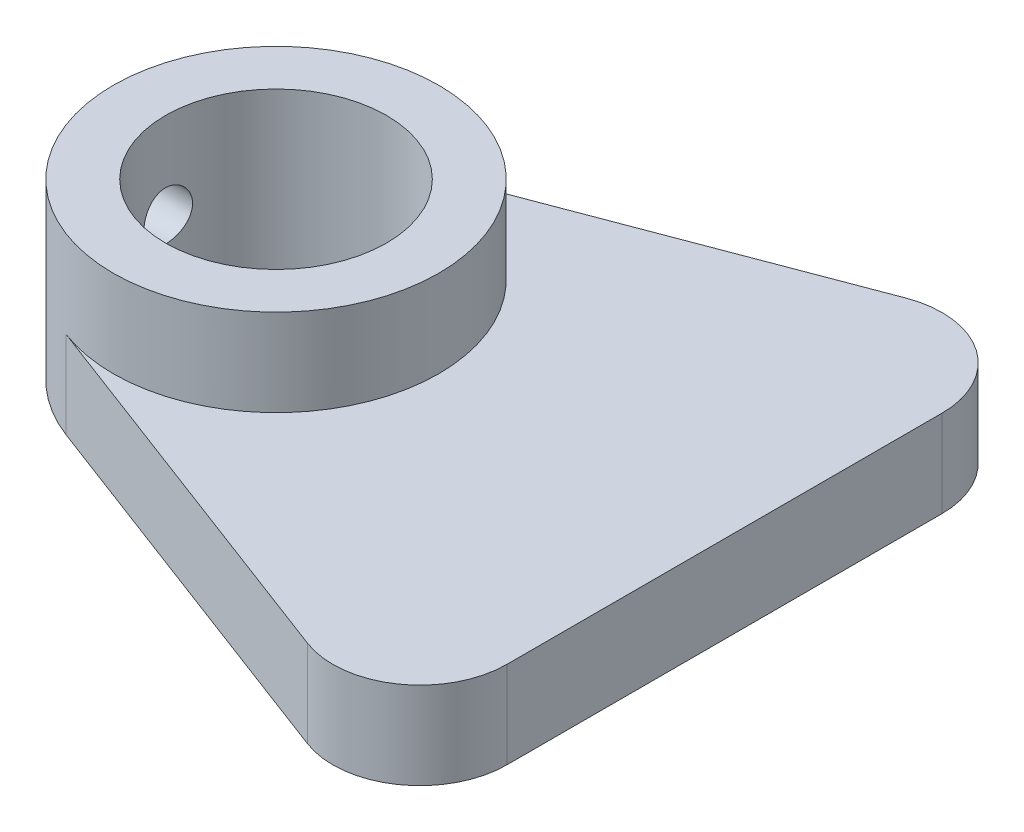
ISO-10303-21;
HEADER;
FILE_DESCRIPTION(('STEP AP214'),'2;1');
FILE_NAME('part.step','',(''),(''),'','','');
FILE_SCHEMA(('AUTOMOTIVE_DESIGN { 1 0 10303 214 1 1 1 1 }'));
ENDSEC;
DATA;
#1=APPLICATION_CONTEXT('core data for automotive mechanical design processes');
#2=APPLICATION_PROTOCOL_DEFINITION('international standard','automotive_design',2000,#1);
#3=PRODUCT_CONTEXT('',#1,'mechanical');
#4=PRODUCT('Part','Part','',(#3));
#5=PRODUCT_RELATED_PRODUCT_CATEGORY('part','',(#4));
#6=PRODUCT_DEFINITION_FORMATION('','',#4);
#7=PRODUCT_DEFINITION_CONTEXT('part definition',#1,'design');
#8=PRODUCT_DEFINITION('design','',#6,#7);
#9=PRODUCT_DEFINITION_SHAPE('','',#8);
#10=(LENGTH_UNIT() NAMED_UNIT(*) SI_UNIT(.MILLI.,.METRE.));
#11=(NAMED_UNIT(*) PLANE_ANGLE_UNIT() SI_UNIT($,.RADIAN.));
#12=(NAMED_UNIT(*) SI_UNIT($,.STERADIAN.) SOLID_ANGLE_UNIT());
#13=UNCERTAINTY_MEASURE_WITH_UNIT(LENGTH_MEASURE(1.E-05),#10,'distance_accuracy_value','');
#14=(GEOMETRIC_REPRESENTATION_CONTEXT(3) GLOBAL_UNCERTAINTY_ASSIGNED_CONTEXT((#13)) GLOBAL_UNIT_ASSIGNED_CONTEXT((#10,
#11,#12)) REPRESENTATION_CONTEXT('',''));
#15=CARTESIAN_POINT('',(0.,0.,0.));
#16=DIRECTION('',(0.,0.,1.));
#17=DIRECTION('',(1.,0.,0.));
#18=AXIS2_PLACEMENT_3D('',#15,#16,#17);
#19=CARTESIAN_POINT('',(0.,5.,0.));
#20=DIRECTION('',(0.,-1.,0.));
#21=DIRECTION('',(0.,0.,-1.));
#22=AXIS2_PLACEMENT_3D('',#19,#20,#21);
#23=CYLINDRICAL_SURFACE('',#22,9.35);
#24=CARTESIAN_POINT('',(-9.35,3.6,0.));
#25=CARTESIAN_POINT('',(-9.34999874871688,3.60000322488676,-0.0781697697484652));
#26=CARTESIAN_POINT('',(-9.34900942942838,3.60656907978243,-0.156384937662956));
#27=CARTESIAN_POINT('',(-9.34515805313962,3.63265243348863,-0.31062915705414));
#28=CARTESIAN_POINT('',(-9.34229417119646,3.65218255366216,-0.386656002758864));
#29=CARTESIAN_POINT('',(-9.3350155144029,3.70359788336311,-0.534269026237014));
#30=CARTESIAN_POINT('',(-9.33060191048971,3.7354737665613,-0.605858508872964));
#31=CARTESIAN_POINT('',(-9.32071154831377,3.81065302156015,-0.742661516835349));
#32=CARTESIAN_POINT('',(-9.31523493813587,3.85395480194808,-0.807875928357151));
#33=CARTESIAN_POINT('',(-9.30377992942692,3.95111589165141,-0.930596282886239));
#34=CARTESIAN_POINT('',(-9.29779830317519,4.00504659708266,-0.988045404331283));
#35=CARTESIAN_POINT('',(-9.28603270151618,4.12178101226572,-1.09311417507362));
#36=CARTESIAN_POINT('',(-9.28024873747778,4.18458523133017,-1.14073325977039));
#37=CARTESIAN_POINT('',(-9.26950200939372,4.31766552271151,-1.22501130345701));
#38=CARTESIAN_POINT('',(-9.26454341639824,4.38797676397296,-1.26161530649952));
#39=CARTESIAN_POINT('',(-9.25605290156957,4.53383588434249,-1.3224729340144));
#40=CARTESIAN_POINT('',(-9.252520902261,4.60938347881386,-1.34672722919268));
#41=CARTESIAN_POINT('',(-9.24731519529666,4.76297329712973,-1.38202052980791));
#42=CARTESIAN_POINT('',(-9.245627817676,4.84099269933156,-1.39315679764552));
#43=CARTESIAN_POINT('',(-9.24426089714928,4.99780968491307,-1.40219923133404));
#44=CARTESIAN_POINT('',(-9.24458123936433,5.07660722351129,-1.40010615414924));
#45=CARTESIAN_POINT('',(-9.24718106388923,5.23205673856489,-1.38282880159643));
#46=CARTESIAN_POINT('',(-9.24944433629545,5.30872106358012,-1.36775283941635));
#47=CARTESIAN_POINT('',(-9.25564968499566,5.45841955397494,-1.32510721504758));
#48=CARTESIAN_POINT('',(-9.25959180862631,5.53145361693132,-1.29753720057693));
#49=CARTESIAN_POINT('',(-9.26872859104725,5.67214804320945,-1.23057338621479));
#50=CARTESIAN_POINT('',(-9.2739280957022,5.73978623637852,-1.19113369396319));
#51=CARTESIAN_POINT('',(-9.28499028001498,5.86752557940347,-1.10158275753212));
#52=CARTESIAN_POINT('',(-9.29085300303396,5.92762623591371,-1.05147081541285));
#53=CARTESIAN_POINT('',(-9.30265266631737,6.03921222015864,-0.941403260378514));
#54=CARTESIAN_POINT('',(-9.30858976393017,6.09060571635497,-0.881354520899215));
#55=CARTESIAN_POINT('',(-9.31981494517203,6.18259951058959,-0.753435372693535));
#56=CARTESIAN_POINT('',(-9.32510302597729,6.22319976166831,-0.685564929938096));
#57=CARTESIAN_POINT('',(-9.33443984701437,6.29245924462512,-0.543849469503863));
#58=CARTESIAN_POINT('',(-9.33848785307956,6.32111140643761,-0.470000945175467));
#59=CARTESIAN_POINT('',(-9.34488227753888,6.36558162333097,-0.318466279206238));
#60=CARTESIAN_POINT('',(-9.34722881055348,6.3814005429373,-0.240780396447381));
#61=CARTESIAN_POINT('',(-9.34994072015745,6.39963315841617,-0.0845688204186976));
#62=CARTESIAN_POINT('',(-9.35032475486863,6.40217310723019,-0.0060581750402724));
#63=CARTESIAN_POINT('',(-9.34911918188856,6.39411077390994,0.150267939257518));
#64=CARTESIAN_POINT('',(-9.34752963507232,6.38350889713461,0.22808342954434));
#65=CARTESIAN_POINT('',(-9.34256704470955,6.34956884396408,0.380428029787219));
#66=CARTESIAN_POINT('',(-9.33920261479644,6.32629216188212,0.454971144400069));
#67=CARTESIAN_POINT('',(-9.3310662904935,6.2677280759464,0.599096692983344));
#68=CARTESIAN_POINT('',(-9.3262943302115,6.23244010978403,0.668678894523988));
#69=CARTESIAN_POINT('',(-9.31582690170958,6.15055884679722,0.801462694338486));
#70=CARTESIAN_POINT('',(-9.31012498918379,6.10388544494589,0.864614378423457));
#71=CARTESIAN_POINT('',(-9.29845240281331,6.00066974573449,0.982233598389389));
#72=CARTESIAN_POINT('',(-9.29248171342227,5.94412687696799,1.03670063111088));
#73=CARTESIAN_POINT('',(-9.28088536352787,5.82221530441306,1.1358636850102));
#74=CARTESIAN_POINT('',(-9.27526296850797,5.7567774115811,1.18047508478979));
#75=CARTESIAN_POINT('',(-9.26505758810144,5.61926268073271,1.25807236489715));
#76=CARTESIAN_POINT('',(-9.26047457471152,5.54718602165325,1.29105855844755));
#77=CARTESIAN_POINT('',(-9.25289048228974,5.39869232235303,1.34433785184353));
#78=CARTESIAN_POINT('',(-9.24988385469927,5.32229156892482,1.36467551966321));
#79=CARTESIAN_POINT('',(-9.24577818693264,5.16711045828071,1.39222231230225));
#80=CARTESIAN_POINT('',(-9.24467901553245,5.08833026513849,1.39943234024328));
#81=CARTESIAN_POINT('',(-9.24451759901034,4.93146998917455,1.40049775932537));
#82=CARTESIAN_POINT('',(-9.24543505980091,4.85339079838786,1.39448620360745));
#83=CARTESIAN_POINT('',(-9.24915943269348,4.69936717511711,1.36956418843293));
#84=CARTESIAN_POINT('',(-9.25196634180998,4.62342273926015,1.35065374935777));
#85=CARTESIAN_POINT('',(-9.25914625789302,4.47586106038163,1.30051775187414));
#86=CARTESIAN_POINT('',(-9.26351808622189,4.40424060801587,1.2693014599788));
#87=CARTESIAN_POINT('',(-9.27333668736396,4.26723205351419,1.19545311421044));
#88=CARTESIAN_POINT('',(-9.27878349631215,4.20184416099252,1.15282067657168));
#89=CARTESIAN_POINT('',(-9.29020359889822,4.07848080836084,1.05686670983585));
#90=CARTESIAN_POINT('',(-9.2961814389745,4.02058241387143,1.00344663100054));
#91=CARTESIAN_POINT('',(-9.30795207199957,3.91452444181267,0.88764202440313));
#92=CARTESIAN_POINT('',(-9.31374482160707,3.86636713137199,0.825255415547024));
#93=CARTESIAN_POINT('',(-9.3245288563622,3.78092255748261,0.692886342071508));
#94=CARTESIAN_POINT('',(-9.32951557266851,3.7436963457288,0.62286410282344));
#95=CARTESIAN_POINT('',(-9.33808084969406,3.68158888130135,0.477519402167572));
#96=CARTESIAN_POINT('',(-9.34166086885329,3.65669483582278,0.402202526201557));
#97=CARTESIAN_POINT('',(-9.34619167419596,3.62560934983679,0.272122755840347));
#98=CARTESIAN_POINT('',(-9.34761246593871,3.61602051092222,0.218162979153408));
#99=CARTESIAN_POINT('',(-9.34951706124275,3.60321474604359,0.109476218593726));
#100=CARTESIAN_POINT('',(-9.35000087638489,3.5999977413249,0.0547492442118158));
#101=CARTESIAN_POINT('',(-9.35,3.6,0.));
#102=B_SPLINE_CURVE_WITH_KNOTS('',3,(#24,#25,#26,#27,#28,#29,#30,#31,#32,#33,#34,#35,#36,#37,
#38,#39,#40,#41,#42,#43,#44,#45,#46,#47,#48,#49,#50,#51,#52,#53,#54,#55,#56,#57,#58,#59,#60,#61,
#62,#63,#64,#65,#66,#67,#68,#69,#70,#71,#72,#73,#74,#75,#76,#77,#78,#79,#80,#81,#82,#83,#84,#85,
#86,#87,#88,#89,#90,#91,#92,#93,#94,#95,#96,#97,#98,#99,#100,#101),.UNSPECIFIED.,.T.,.F.,(4,2,2,
2,2,2,2,2,2,2,2,2,2,2,2,2,2,2,2,2,2,2,2,2,2,2,2,2,2,2,2,2,2,2,2,2,2,2,4),(0.,0.234309250370285,
0.468846947765941,0.703207813421613,0.93753605422797,1.17349553318355,1.40946856100014,
1.6466000867985,1.88371873273856,2.11906799154291,2.35440378411946,2.5877950381366,
2.82119287325667,3.05550495979368,3.28983237449298,3.52649514169865,3.76315893856687,
3.99996257891291,4.23675026539642,4.47128248832785,4.70580747730482,4.93920463078247,
5.17261271225813,5.40771292022306,5.64282674415729,5.87988694156806,6.11694075128182,
6.35315448121235,6.58935196010304,6.82318339162325,7.05701445366881,7.29066977232527,
7.52433294653691,7.76023605526973,7.9961940048076,8.23344578341158,8.47045093018296,
8.63456057216558,8.79866818577234),.UNSPECIFIED.);
#103=CARTESIAN_POINT('',(-9.35,3.6,0.));
#104=VERTEX_POINT('',#103);
#105=EDGE_CURVE('E208',#104,#104,#102,.T.);
#106=ORIENTED_EDGE('',*,*,#105,.T.);
#107=EDGE_LOOP('',(#106));
#108=FACE_BOUND('',#107,.T.);
#109=CARTESIAN_POINT('',(0.,0.,0.));
#110=DIRECTION('',(0.,1.,0.));
#111=DIRECTION('',(0.,0.,1.));
#112=AXIS2_PLACEMENT_3D('',#109,#110,#111);
#113=CIRCLE('',#112,9.35);
#114=CARTESIAN_POINT('',(-3.30679215880863,0.,-8.74572041734937));
#115=VERTEX_POINT('',#114);
#116=CARTESIAN_POINT('',(-3.30679215880863,0.,8.74572041734937));
#117=VERTEX_POINT('',#116);
#118=EDGE_CURVE('E150',#115,#117,#113,.T.);
#119=ORIENTED_EDGE('',*,*,#118,.T.);
#120=DIRECTION('',(0.,-1.,0.));
#121=VECTOR('',#120,1.);
#122=CARTESIAN_POINT('',(-3.30679215880863,5.,8.74572041734937));
#123=LINE('',#122,#121);
#124=CARTESIAN_POINT('',(-3.30679215880863,5.,8.74572041734937));
#125=VERTEX_POINT('',#124);
#126=EDGE_CURVE('E11',#125,#117,#123,.T.);
#127=ORIENTED_EDGE('',*,*,#126,.F.);
#128=CARTESIAN_POINT('',(0.,5.,0.));
#129=DIRECTION('',(0.,1.,0.));
#130=DIRECTION('',(0.,0.,1.));
#131=AXIS2_PLACEMENT_3D('',#128,#129,#130);
#132=CIRCLE('',#131,9.35);
#133=CARTESIAN_POINT('',(-3.30679215880863,5.,-8.74572041734937));
#134=VERTEX_POINT('',#133);
#135=EDGE_CURVE('E107',#134,#125,#132,.F.);
#136=ORIENTED_EDGE('',*,*,#135,.F.);
#137=DIRECTION('',(0.,-1.,0.));
#138=VECTOR('',#137,1.);
#139=CARTESIAN_POINT('',(-3.30679215880863,5.,-8.74572041734937));
#140=LINE('',#139,#138);
#141=EDGE_CURVE('E101',#134,#115,#140,.T.);
#142=ORIENTED_EDGE('',*,*,#141,.T.);
#143=EDGE_LOOP('',(#119,#127,#136,#142));
#144=FACE_BOUND('',#143,.T.);
#145=CARTESIAN_POINT('',(0.,10.,0.));
#146=DIRECTION('',(0.,1.,0.));
#147=DIRECTION('',(0.,0.,1.));
#148=AXIS2_PLACEMENT_3D('',#145,#146,#147);
#149=CIRCLE('',#148,9.35);
#150=CARTESIAN_POINT('',(0.,10.,9.35));
#151=VERTEX_POINT('',#150);
#152=EDGE_CURVE('E187',#151,#151,#149,.T.);
#153=ORIENTED_EDGE('',*,*,#152,.F.);
#154=EDGE_LOOP('',(#153));
#155=FACE_BOUND('',#154,.T.);
#156=ADVANCED_FACE('F45',(#108,#144,#155),#23,.T.);
#157=CARTESIAN_POINT('',(-3.30679215880863,5.,8.74572041734937));
#158=DIRECTION('',(0.353667610567768,0.,-0.935371167630949));
#159=DIRECTION('',(-0.935371167630949,0.,-0.353667610567768));
#160=AXIS2_PLACEMENT_3D('',#157,#158,#159);
#161=PLANE('',#160);
#162=DIRECTION('',(0.935371167630949,0.,0.353667610567768));
#163=VECTOR('',#162,1.);
#164=CARTESIAN_POINT('',(-3.30679215880863,0.,8.74572041734937));
#165=LINE('',#164,#163);
#166=CARTESIAN_POINT('',(18.9916619471612,0.,17.1768558381547));
#167=VERTEX_POINT('',#166);
#168=EDGE_CURVE('E153',#117,#167,#165,.T.);
#169=ORIENTED_EDGE('',*,*,#168,.T.);
#170=DIRECTION('',(0.,-1.,0.));
#171=VECTOR('',#170,1.);
#172=CARTESIAN_POINT('',(18.9916619471612,5.,17.1768558381547));
#173=LINE('',#172,#171);
#174=CARTESIAN_POINT('',(18.9916619471612,5.,17.1768558381547));
#175=VERTEX_POINT('',#174);
#176=EDGE_CURVE('E61',#175,#167,#173,.T.);
#177=ORIENTED_EDGE('',*,*,#176,.F.);
#178=DIRECTION('',(0.935371167630949,0.,0.353667610567768));
#179=VECTOR('',#178,1.);
#180=CARTESIAN_POINT('',(-3.30679215880863,5.,8.74572041734937));
#181=LINE('',#180,#179);
#182=EDGE_CURVE('E118',#125,#175,#181,.T.);
#183=ORIENTED_EDGE('',*,*,#182,.F.);
#184=ORIENTED_EDGE('',*,*,#126,.T.);
#185=EDGE_LOOP('',(#169,#177,#183,#184));
#186=FACE_BOUND('',#185,.T.);
#187=ADVANCED_FACE('F237',(#186),#161,.F.);
#188=CARTESIAN_POINT('',(20.76,5.,12.5));
#189=DIRECTION('',(0.,-1.,0.));
#190=DIRECTION('',(0.,0.,-1.));
#191=AXIS2_PLACEMENT_3D('',#188,#189,#190);
#192=CYLINDRICAL_SURFACE('',#191,5.);
#193=CARTESIAN_POINT('',(20.76,0.,12.5));
#194=DIRECTION('',(0.,1.,0.));
#195=DIRECTION('',(0.,0.,1.));
#196=AXIS2_PLACEMENT_3D('',#193,#194,#195);
#197=CIRCLE('',#196,5.);
#198=CARTESIAN_POINT('',(25.76,0.,12.5));
#199=VERTEX_POINT('',#198);
#200=EDGE_CURVE('E128',#167,#199,#197,.T.);
#201=ORIENTED_EDGE('',*,*,#200,.T.);
#202=DIRECTION('',(0.,-1.,0.));
#203=VECTOR('',#202,1.);
#204=CARTESIAN_POINT('',(25.76,5.,12.5));
#205=LINE('',#204,#203);
#206=CARTESIAN_POINT('',(25.76,5.,12.5));
#207=VERTEX_POINT('',#206);
#208=EDGE_CURVE('E125',#207,#199,#205,.T.);
#209=ORIENTED_EDGE('',*,*,#208,.F.);
#210=CARTESIAN_POINT('',(20.76,5.,12.5));
#211=DIRECTION('',(0.,1.,0.));
#212=DIRECTION('',(0.,0.,1.));
#213=AXIS2_PLACEMENT_3D('',#210,#211,#212);
#214=CIRCLE('',#213,5.);
#215=EDGE_CURVE('E113',#175,#207,#214,.T.);
#216=ORIENTED_EDGE('',*,*,#215,.F.);
#217=ORIENTED_EDGE('',*,*,#176,.T.);
#218=EDGE_LOOP('',(#201,#209,#216,#217));
#219=FACE_BOUND('',#218,.T.);
#220=ADVANCED_FACE('F126',(#219),#192,.T.);
#221=CARTESIAN_POINT('',(25.76,5.,0.));
#222=DIRECTION('',(1.,0.,0.));
#223=DIRECTION('',(0.,0.,-1.));
#224=AXIS2_PLACEMENT_3D('',#221,#222,#223);
#225=PLANE('',#224);
#226=DIRECTION('',(0.,0.,1.));
#227=VECTOR('',#226,1.);
#228=CARTESIAN_POINT('',(25.76,0.,0.));
#229=LINE('',#228,#227);
#230=CARTESIAN_POINT('',(25.76,0.,-12.5));
#231=VERTEX_POINT('',#230);
#232=EDGE_CURVE('E158',#231,#199,#229,.T.);
#233=ORIENTED_EDGE('',*,*,#232,.F.);
#234=DIRECTION('',(0.,-1.,0.));
#235=VECTOR('',#234,1.);
#236=CARTESIAN_POINT('',(25.76,5.,-12.5));
#237=LINE('',#236,#235);
#238=CARTESIAN_POINT('',(25.76,5.,-12.5));
#239=VERTEX_POINT('',#238);
#240=EDGE_CURVE('E133',#239,#231,#237,.T.);
#241=ORIENTED_EDGE('',*,*,#240,.F.);
#242=DIRECTION('',(0.,0.,1.));
#243=VECTOR('',#242,1.);
#244=CARTESIAN_POINT('',(25.76,5.,0.));
#245=LINE('',#244,#243);
#246=EDGE_CURVE('E117',#239,#207,#245,.T.);
#247=ORIENTED_EDGE('',*,*,#246,.T.);
#248=ORIENTED_EDGE('',*,*,#208,.T.);
#249=EDGE_LOOP('',(#233,#241,#247,#248));
#250=FACE_BOUND('',#249,.T.);
#251=ADVANCED_FACE('F135',(#250),#225,.T.);
#252=CARTESIAN_POINT('',(20.76,5.,-12.5));
#253=DIRECTION('',(0.,-1.,0.));
#254=DIRECTION('',(0.,0.,-1.));
#255=AXIS2_PLACEMENT_3D('',#252,#253,#254);
#256=CYLINDRICAL_SURFACE('',#255,5.);
#257=CARTESIAN_POINT('',(20.76,0.,-12.5));
#258=DIRECTION('',(0.,1.,0.));
#259=DIRECTION('',(0.,0.,1.));
#260=AXIS2_PLACEMENT_3D('',#257,#258,#259);
#261=CIRCLE('',#260,5.);
#262=CARTESIAN_POINT('',(18.9916619471612,0.,-17.1768558381547));
#263=VERTEX_POINT('',#262);
#264=EDGE_CURVE('E161',#231,#263,#261,.T.);
#265=ORIENTED_EDGE('',*,*,#264,.T.);
#266=DIRECTION('',(0.,-1.,0.));
#267=VECTOR('',#266,1.);
#268=CARTESIAN_POINT('',(18.9916619471612,5.,-17.1768558381547));
#269=LINE('',#268,#267);
#270=CARTESIAN_POINT('',(18.9916619471612,5.,-17.1768558381547));
#271=VERTEX_POINT('',#270);
#272=EDGE_CURVE('E93',#271,#263,#269,.T.);
#273=ORIENTED_EDGE('',*,*,#272,.F.);
#274=CARTESIAN_POINT('',(20.76,5.,-12.5));
#275=DIRECTION('',(0.,1.,0.));
#276=DIRECTION('',(0.,0.,1.));
#277=AXIS2_PLACEMENT_3D('',#274,#275,#276);
#278=CIRCLE('',#277,5.);
#279=EDGE_CURVE('E69',#239,#271,#278,.T.);
#280=ORIENTED_EDGE('',*,*,#279,.F.);
#281=ORIENTED_EDGE('',*,*,#240,.T.);
#282=EDGE_LOOP('',(#265,#273,#280,#281));
#283=FACE_BOUND('',#282,.T.);
#284=ADVANCED_FACE('F182',(#283),#256,.T.);
#285=CARTESIAN_POINT('',(0.,5.,0.));
#286=DIRECTION('',(0.,-1.,0.));
#287=DIRECTION('',(0.,0.,-1.));
#288=AXIS2_PLACEMENT_3D('',#285,#286,#287);
#289=CYLINDRICAL_SURFACE('',#288,6.35);
#290=CARTESIAN_POINT('',(-6.19374684661877,5.,-1.4));
#291=CARTESIAN_POINT('',(-6.19374841494423,5.07760622942105,-1.39999735223189));
#292=CARTESIAN_POINT('',(-6.19522131779223,5.15524414254004,-1.39352512949226));
#293=CARTESIAN_POINT('',(-6.20094273842287,5.30831095445648,-1.36783625256079));
#294=CARTESIAN_POINT('',(-6.20519324211269,5.38373823236533,-1.34861047978735));
#295=CARTESIAN_POINT('',(-6.21596560433523,5.5301474752009,-1.29805023179138));
#296=CARTESIAN_POINT('',(-6.2224849469684,5.60113426171786,-1.26672916475525));
#297=CARTESIAN_POINT('',(-6.23705738832785,5.73684750344382,-1.19290592932587));
#298=CARTESIAN_POINT('',(-6.24511046064515,5.80157406641738,-1.15040395344957));
#299=CARTESIAN_POINT('',(-6.2619973953809,5.92404117588797,-1.05464784534151));
#300=CARTESIAN_POINT('',(-6.27084138082884,5.98165864000593,-1.00123805492983));
#301=CARTESIAN_POINT('',(-6.2882250668152,6.08719370736385,-0.885518411834659));
#302=CARTESIAN_POINT('',(-6.29676474342176,6.13511054909564,-0.823207861087311));
#303=CARTESIAN_POINT('',(-6.31268795729434,6.2203719346031,-0.690629297263067));
#304=CARTESIAN_POINT('',(-6.32005815700129,6.25759796268659,-0.620283326908143));
#305=CARTESIAN_POINT('',(-6.33269758841189,6.31965405262247,-0.474144400272669));
#306=CARTESIAN_POINT('',(-6.3379670597027,6.3444855281495,-0.398352066311804));
#307=CARTESIAN_POINT('',(-6.34573977080403,6.3806601510627,-0.244751836659834));
#308=CARTESIAN_POINT('',(-6.3482856947264,6.39221164748807,-0.166995206027449));
#309=CARTESIAN_POINT('',(-6.35047238691971,6.40214996399966,-0.0106088045723574));
#310=CARTESIAN_POINT('',(-6.35011349265103,6.40053831328321,0.0680208637674266));
#311=CARTESIAN_POINT('',(-6.34656356304481,6.38435097906154,0.222484578589357));
#312=CARTESIAN_POINT('',(-6.34342159403537,6.36999988574625,0.298343455263481));
#313=CARTESIAN_POINT('',(-6.33471451939126,6.32909909532836,0.446548946664486));
#314=CARTESIAN_POINT('',(-6.3291493030494,6.30254884089829,0.518895400756828));
#315=CARTESIAN_POINT('',(-6.31614234547206,6.2378056355902,0.658644181524316));
#316=CARTESIAN_POINT('',(-6.30868699813534,6.19952782860063,0.726005877583422));
#317=CARTESIAN_POINT('',(-6.29271679259167,6.11247941498844,0.853431524176358));
#318=CARTESIAN_POINT('',(-6.28420178796139,6.06370735759123,0.913494463897509));
#319=CARTESIAN_POINT('',(-6.26683573288302,5.95583313961061,1.02595360230183));
#320=CARTESIAN_POINT('',(-6.25798138369601,5.89653442535151,1.07816091914626));
#321=CARTESIAN_POINT('',(-6.24110298088458,5.76993188087404,1.17192575701002));
#322=CARTESIAN_POINT('',(-6.2330789505059,5.70262782665019,1.21348297991568));
#323=CARTESIAN_POINT('',(-6.21876080641967,5.56161634678097,1.2848538108177));
#324=CARTESIAN_POINT('',(-6.21247204365773,5.48789001675927,1.31463121382326));
#325=CARTESIAN_POINT('',(-6.20241026801494,5.33630825976777,1.36131669331642));
#326=CARTESIAN_POINT('',(-6.19863684898606,5.25845350160056,1.37822684751796));
#327=CARTESIAN_POINT('',(-6.19411596879859,5.10255215311493,1.39840377218717));
#328=CARTESIAN_POINT('',(-6.19330746995889,5.02454291420888,1.40194579255794));
#329=CARTESIAN_POINT('',(-6.19464324002806,4.86904857846131,1.3960315536116));
#330=CARTESIAN_POINT('',(-6.19678730257543,4.79156344536916,1.38657620271156));
#331=CARTESIAN_POINT('',(-6.20372892921873,4.6402785628264,1.35517457684555));
#332=CARTESIAN_POINT('',(-6.20849417210478,4.56644563190014,1.33338035592029));
#333=CARTESIAN_POINT('',(-6.22011199894049,4.4234794457706,1.27808449193225));
#334=CARTESIAN_POINT('',(-6.22696478530388,4.35434664710001,1.24458171353045));
#335=CARTESIAN_POINT('',(-6.24211937097206,4.22155330991487,1.1662149393382));
#336=CARTESIAN_POINT('',(-6.25044213289103,4.15799512163937,1.12118164709335));
#337=CARTESIAN_POINT('',(-6.26754382728552,4.03923686802175,1.02125329970387));
#338=CARTESIAN_POINT('',(-6.27632281726411,3.98403785972067,0.966356999270834));
#339=CARTESIAN_POINT('',(-6.29354929883296,3.88249404361341,0.847014446272044));
#340=CARTESIAN_POINT('',(-6.30198734405535,3.83633704135586,0.782406801560421));
#341=CARTESIAN_POINT('',(-6.31740633059219,3.75553158482297,0.64619506268429));
#342=CARTESIAN_POINT('',(-6.32438734052437,3.72088258854341,0.574591298228756));
#343=CARTESIAN_POINT('',(-6.33606590841665,3.66433702920784,0.426869549746665));
#344=CARTESIAN_POINT('',(-6.34077802846514,3.64235895735325,0.350783969661727));
#345=CARTESIAN_POINT('',(-6.34745089628105,3.61152501357343,0.19588481074989));
#346=CARTESIAN_POINT('',(-6.34941205077818,3.60266720180953,0.117071636963134));
#347=CARTESIAN_POINT('',(-6.35034970286836,3.59841360492631,-0.0392636373199488));
#348=CARTESIAN_POINT('',(-6.34938832913177,3.6027375994612,-0.116777873137778));
#349=CARTESIAN_POINT('',(-6.34472230294462,3.62409728839434,-0.269945879421722));
#350=CARTESIAN_POINT('',(-6.34101770135135,3.64113274713209,-0.345599684351898));
#351=CARTESIAN_POINT('',(-6.33128634026787,3.68729659968654,-0.492678492945368));
#352=CARTESIAN_POINT('',(-6.32526732955764,3.71638466560184,-0.56411669977335));
#353=CARTESIAN_POINT('',(-6.31154938761597,3.78578893109656,-0.701135551472126));
#354=CARTESIAN_POINT('',(-6.30385029052955,3.82610623931434,-0.766715617136797));
#355=CARTESIAN_POINT('',(-6.28742649821327,3.91773514192107,-0.891521538570716));
#356=CARTESIAN_POINT('',(-6.27868491271979,3.96924344265934,-0.950600768246307));
#357=CARTESIAN_POINT('',(-6.26125152381091,4.08139619327862,-1.05937290605848));
#358=CARTESIAN_POINT('',(-6.25255973293082,4.14204284706165,-1.10906354340917));
#359=CARTESIAN_POINT('',(-6.23607780755743,4.27174524060313,-1.19830138622969));
#360=CARTESIAN_POINT('',(-6.22830158174108,4.34090435536275,-1.23770106125685));
#361=CARTESIAN_POINT('',(-6.21470669330077,4.48501944549934,-1.30425588040803));
#362=CARTESIAN_POINT('',(-6.20888638685208,4.55997048763556,-1.331421313193));
#363=CARTESIAN_POINT('',(-6.20092985880705,4.69582328112183,-1.36792817581107));
#364=CARTESIAN_POINT('',(-6.19825422743617,4.75599217994225,-1.37993188689902));
#365=CARTESIAN_POINT('',(-6.19466214626395,4.87743416851129,-1.3959686441057));
#366=CARTESIAN_POINT('',(-6.19374560796751,4.93870720255738,-1.4000020911867));
#367=CARTESIAN_POINT('',(-6.19374684661877,5.,-1.4));
#368=B_SPLINE_CURVE_WITH_KNOTS('',3,(#290,#291,#292,#293,#294,#295,#296,#297,#298,#299,#300,
#301,#302,#303,#304,#305,#306,#307,#308,#309,#310,#311,#312,#313,#314,#315,#316,#317,#318,#319,
#320,#321,#322,#323,#324,#325,#326,#327,#328,#329,#330,#331,#332,#333,#334,#335,#336,#337,#338,
#339,#340,#341,#342,#343,#344,#345,#346,#347,#348,#349,#350,#351,#352,#353,#354,#355,#356,#357,
#358,#359,#360,#361,#362,#363,#364,#365,#366,#367),.UNSPECIFIED.,.T.,.F.,(4,2,2,2,2,2,2,2,2,2,2,
2,2,2,2,2,2,2,2,2,2,2,2,2,2,2,2,2,2,2,2,2,2,2,2,2,2,2,4),(0.,0.232594032140486,
0.465354544746923,0.697857768967264,0.930356990124686,1.16644050945121,1.40254255438031,
1.64116897964311,1.87976818187777,2.11457060783881,2.3493457565743,2.58006235941637,
2.8107895037609,3.04322718856403,3.27569702731594,3.51308047735243,3.75047057141742,
3.98858471277401,4.22666039694928,4.45980648540864,4.69293627956413,4.92325382682848,
5.15359371340173,5.3875316964558,5.62149923694706,5.85990465872548,6.09829885048917,
6.33514189282524,6.5719499142727,6.80375920266095,7.03556419359478,7.26659975176259,
7.49765812765244,7.73316453445793,7.96872782965853,8.20750275591751,8.44607650234499,
8.62978670520664,8.81348766587311),.UNSPECIFIED.);
#369=CARTESIAN_POINT('',(-6.19374684661877,5.,-1.4));
#370=VERTEX_POINT('',#369);
#371=EDGE_CURVE('E50',#370,#370,#368,.T.);
#372=ORIENTED_EDGE('',*,*,#371,.F.);
#373=EDGE_LOOP('',(#372));
#374=FACE_BOUND('',#373,.T.);
#375=CARTESIAN_POINT('',(0.,0.,0.));
#376=DIRECTION('',(0.,1.,0.));
#377=DIRECTION('',(0.,0.,1.));
#378=AXIS2_PLACEMENT_3D('',#375,#376,#377);
#379=CIRCLE('',#378,6.35);
#380=CARTESIAN_POINT('',(0.,0.,6.35));
#381=VERTEX_POINT('',#380);
#382=EDGE_CURVE('E146',#381,#381,#379,.T.);
#383=ORIENTED_EDGE('',*,*,#382,.F.);
#384=EDGE_LOOP('',(#383));
#385=FACE_BOUND('',#384,.T.);
#386=CARTESIAN_POINT('',(0.,10.,0.));
#387=DIRECTION('',(0.,1.,0.));
#388=DIRECTION('',(0.,0.,1.));
#389=AXIS2_PLACEMENT_3D('',#386,#387,#388);
#390=CIRCLE('',#389,6.35);
#391=CARTESIAN_POINT('',(0.,10.,6.35));
#392=VERTEX_POINT('',#391);
#393=EDGE_CURVE('E192',#392,#392,#390,.T.);
#394=ORIENTED_EDGE('',*,*,#393,.T.);
#395=EDGE_LOOP('',(#394));
#396=FACE_BOUND('',#395,.T.);
#397=ADVANCED_FACE('F47',(#374,#385,#396),#289,.F.);
#398=CARTESIAN_POINT('',(-3.30679215880863,5.,-8.74572041734937));
#399=DIRECTION('',(-0.353667610567768,0.,-0.935371167630949));
#400=DIRECTION('',(-0.935371167630949,0.,0.353667610567768));
#401=AXIS2_PLACEMENT_3D('',#398,#399,#400);
#402=PLANE('',#401);
#403=DIRECTION('',(0.935371167630949,0.,-0.353667610567768));
#404=VECTOR('',#403,1.);
#405=CARTESIAN_POINT('',(-3.30679215880863,0.,-8.74572041734937));
#406=LINE('',#405,#404);
#407=EDGE_CURVE('E164',#115,#263,#406,.T.);
#408=ORIENTED_EDGE('',*,*,#407,.F.);
#409=ORIENTED_EDGE('',*,*,#141,.F.);
#410=DIRECTION('',(0.935371167630949,0.,-0.353667610567768));
#411=VECTOR('',#410,1.);
#412=CARTESIAN_POINT('',(-3.30679215880863,5.,-8.74572041734937));
#413=LINE('',#412,#411);
#414=EDGE_CURVE('E140',#134,#271,#413,.T.);
#415=ORIENTED_EDGE('',*,*,#414,.T.);
#416=ORIENTED_EDGE('',*,*,#272,.T.);
#417=EDGE_LOOP('',(#408,#409,#415,#416));
#418=FACE_BOUND('',#417,.T.);
#419=ADVANCED_FACE('F183',(#418),#402,.T.);
#420=CARTESIAN_POINT('',(0.,5.,0.));
#421=DIRECTION('',(0.,1.,0.));
#422=DIRECTION('',(0.,0.,1.));
#423=AXIS2_PLACEMENT_3D('',#420,#421,#422);
#424=PLANE('',#423);
#425=ORIENTED_EDGE('',*,*,#414,.F.);
#426=ORIENTED_EDGE('',*,*,#135,.T.);
#427=ORIENTED_EDGE('',*,*,#182,.T.);
#428=ORIENTED_EDGE('',*,*,#215,.T.);
#429=ORIENTED_EDGE('',*,*,#246,.F.);
#430=ORIENTED_EDGE('',*,*,#279,.T.);
#431=EDGE_LOOP('',(#425,#426,#427,#428,#429,#430));
#432=FACE_BOUND('',#431,.T.);
#433=ADVANCED_FACE('F115',(#432),#424,.T.);
#434=CARTESIAN_POINT('',(0.,0.,0.));
#435=DIRECTION('',(0.,1.,0.));
#436=DIRECTION('',(0.,0.,1.));
#437=AXIS2_PLACEMENT_3D('',#434,#435,#436);
#438=PLANE('',#437);
#439=ORIENTED_EDGE('',*,*,#168,.F.);
#440=ORIENTED_EDGE('',*,*,#118,.F.);
#441=ORIENTED_EDGE('',*,*,#407,.T.);
#442=ORIENTED_EDGE('',*,*,#264,.F.);
#443=ORIENTED_EDGE('',*,*,#232,.T.);
#444=ORIENTED_EDGE('',*,*,#200,.F.);
#445=EDGE_LOOP('',(#439,#440,#441,#442,#443,#444));
#446=FACE_BOUND('',#445,.T.);
#447=ORIENTED_EDGE('',*,*,#382,.T.);
#448=EDGE_LOOP('',(#447));
#449=FACE_BOUND('',#448,.T.);
#450=ADVANCED_FACE('F178',(#446,#449),#438,.F.);
#451=CARTESIAN_POINT('',(0.,10.,0.));
#452=DIRECTION('',(0.,1.,0.));
#453=DIRECTION('',(0.,0.,1.));
#454=AXIS2_PLACEMENT_3D('',#451,#452,#453);
#455=PLANE('',#454);
#456=ORIENTED_EDGE('',*,*,#393,.F.);
#457=EDGE_LOOP('',(#456));
#458=FACE_BOUND('',#457,.T.);
#459=ORIENTED_EDGE('',*,*,#152,.T.);
#460=EDGE_LOOP('',(#459));
#461=FACE_BOUND('',#460,.T.);
#462=ADVANCED_FACE('F220',(#458,#461),#455,.T.);
#463=CARTESIAN_POINT('',(-9.35,5.,0.));
#464=DIRECTION('',(1.,0.,0.));
#465=DIRECTION('',(0.,0.,-1.));
#466=AXIS2_PLACEMENT_3D('',#463,#464,#465);
#467=CYLINDRICAL_SURFACE('',#466,1.4);
#468=ORIENTED_EDGE('',*,*,#371,.T.);
#469=EDGE_LOOP('',(#468));
#470=FACE_BOUND('',#469,.T.);
#471=ORIENTED_EDGE('',*,*,#105,.F.);
#472=EDGE_LOOP('',(#471));
#473=FACE_BOUND('',#472,.T.);
#474=ADVANCED_FACE('F216',(#470,#473),#467,.F.);
#475=CLOSED_SHELL('',(#156,#187,#220,#251,#284,#397,#419,#433,#450,#462,#474));
#476=MANIFOLD_SOLID_BREP('B2',#475);
#477=ADVANCED_BREP_SHAPE_REPRESENTATION('',(#18,#476),#14);
#478=SHAPE_DEFINITION_REPRESENTATION(#9,#477);
ENDSEC;
END-ISO-10303-21;
